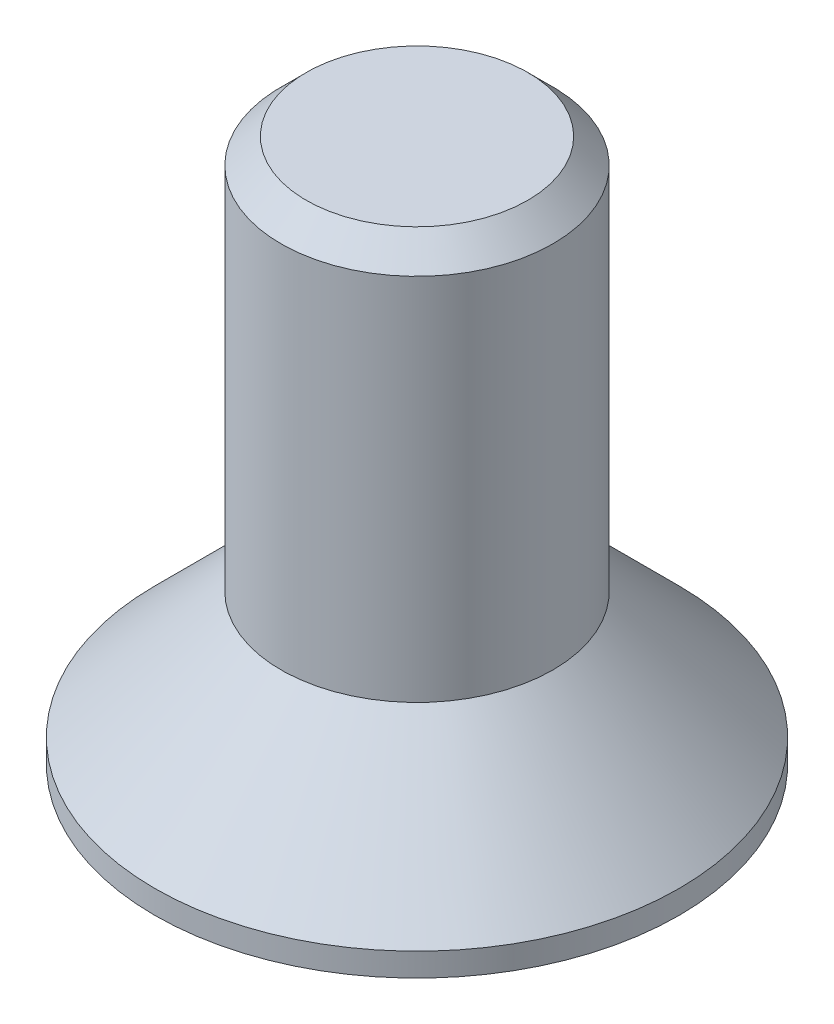
ISO-10303-21;
HEADER;
FILE_DESCRIPTION(('STEP AP214'),'2;1');
FILE_NAME('part.step','',(''),(''),'','','');
FILE_SCHEMA(('AUTOMOTIVE_DESIGN { 1 0 10303 214 1 1 1 1 }'));
ENDSEC;
DATA;
#1=APPLICATION_CONTEXT('core data for automotive mechanical design processes');
#2=APPLICATION_PROTOCOL_DEFINITION('international standard','automotive_design',2000,#1);
#3=PRODUCT_CONTEXT('',#1,'mechanical');
#4=PRODUCT('Part','Part','',(#3));
#5=PRODUCT_RELATED_PRODUCT_CATEGORY('part','',(#4));
#6=PRODUCT_DEFINITION_FORMATION('','',#4);
#7=PRODUCT_DEFINITION_CONTEXT('part definition',#1,'design');
#8=PRODUCT_DEFINITION('design','',#6,#7);
#9=PRODUCT_DEFINITION_SHAPE('','',#8);
#10=(LENGTH_UNIT() NAMED_UNIT(*) SI_UNIT(.MILLI.,.METRE.));
#11=(NAMED_UNIT(*) PLANE_ANGLE_UNIT() SI_UNIT($,.RADIAN.));
#12=(NAMED_UNIT(*) SI_UNIT($,.STERADIAN.) SOLID_ANGLE_UNIT());
#13=UNCERTAINTY_MEASURE_WITH_UNIT(LENGTH_MEASURE(1.E-05),#10,'distance_accuracy_value','');
#14=(GEOMETRIC_REPRESENTATION_CONTEXT(3) GLOBAL_UNCERTAINTY_ASSIGNED_CONTEXT((#13)) GLOBAL_UNIT_ASSIGNED_CONTEXT((#10,
#11,#12)) REPRESENTATION_CONTEXT('',''));
#15=CARTESIAN_POINT('',(0.,0.,0.));
#16=DIRECTION('',(0.,0.,1.));
#17=DIRECTION('',(1.,0.,0.));
#18=AXIS2_PLACEMENT_3D('',#15,#16,#17);
#19=CARTESIAN_POINT('',(2.32094808214229,2.50000000000001,0.));
#20=DIRECTION('',(0.,-1.,0.));
#21=DIRECTION('',(1.,0.,0.));
#22=AXIS2_PLACEMENT_3D('',#19,#20,#21);
#23=PLANE('',#22);
#24=DIRECTION('',(0.499999999999997,0.,-0.86602540378444));
#25=VECTOR('',#24,1.);
#26=CARTESIAN_POINT('',(-1.74071106160673,2.5,-1.005));
#27=LINE('',#26,#25);
#28=CARTESIAN_POINT('',(-1.74071106159993,2.50000000002728,-1.00499999999607));
#29=VERTEX_POINT('',#28);
#30=CARTESIAN_POINT('',(-1.16047404107116,2.5,-2.01));
#31=VERTEX_POINT('',#30);
#32=EDGE_CURVE('E94',#29,#31,#27,.T.);
#33=ORIENTED_EDGE('',*,*,#32,.T.);
#34=DIRECTION('',(1.,0.,0.));
#35=VECTOR('',#34,1.);
#36=CARTESIAN_POINT('',(2.32094808214229,2.50000000000001,-2.01));
#37=LINE('',#36,#35);
#38=CARTESIAN_POINT('',(0.,2.50000000002729,-2.00999999999215));
#39=VERTEX_POINT('',#38);
#40=EDGE_CURVE('E103',#31,#39,#37,.T.);
#41=ORIENTED_EDGE('',*,*,#40,.T.);
#42=CARTESIAN_POINT('',(0.,2.50000000005457,0.));
#43=DIRECTION('',(0.,-1.,0.));
#44=DIRECTION('',(1.,0.,0.));
#45=AXIS2_PLACEMENT_3D('',#42,#43,#44);
#46=CIRCLE('',#45,2.0099999999843);
#47=EDGE_CURVE('E20',#39,#29,#46,.F.);
#48=ORIENTED_EDGE('',*,*,#47,.T.);
#49=EDGE_LOOP('',(#33,#41,#48));
#50=FACE_BOUND('',#49,.T.);
#51=ADVANCED_FACE('F17',(#50),#23,.T.);
#52=CARTESIAN_POINT('',(2.32094808214229,2.50000000000001,0.));
#53=DIRECTION('',(0.,-1.,0.));
#54=DIRECTION('',(1.,0.,0.));
#55=AXIS2_PLACEMENT_3D('',#52,#53,#54);
#56=PLANE('',#55);
#57=DIRECTION('',(-0.499999999999998,0.,-0.86602540378444));
#58=VECTOR('',#57,1.);
#59=CARTESIAN_POINT('',(-1.74071106160673,2.5,1.005));
#60=LINE('',#59,#58);
#61=CARTESIAN_POINT('',(-1.74071106159993,2.50000000002728,1.00499999999608));
#62=VERTEX_POINT('',#61);
#63=CARTESIAN_POINT('',(-2.3209480821423,2.49999999999999,0.));
#64=VERTEX_POINT('',#63);
#65=EDGE_CURVE('E117',#62,#64,#60,.T.);
#66=ORIENTED_EDGE('',*,*,#65,.T.);
#67=DIRECTION('',(0.499999999999998,0.,-0.86602540378444));
#68=VECTOR('',#67,1.);
#69=CARTESIAN_POINT('',(-2.3209480821423,2.49999999999999,0.));
#70=LINE('',#69,#68);
#71=EDGE_CURVE('E98',#64,#29,#70,.T.);
#72=ORIENTED_EDGE('',*,*,#71,.T.);
#73=CARTESIAN_POINT('',(0.,2.50000000005457,0.));
#74=DIRECTION('',(0.,-1.,0.));
#75=DIRECTION('',(1.,0.,0.));
#76=AXIS2_PLACEMENT_3D('',#73,#74,#75);
#77=CIRCLE('',#76,2.0099999999843);
#78=EDGE_CURVE('E110',#29,#62,#77,.F.);
#79=ORIENTED_EDGE('',*,*,#78,.T.);
#80=EDGE_LOOP('',(#66,#72,#79));
#81=FACE_BOUND('',#80,.T.);
#82=ADVANCED_FACE('F115',(#81),#56,.T.);
#83=CARTESIAN_POINT('',(2.32094808214229,2.50000000000001,0.));
#84=DIRECTION('',(0.,-1.,0.));
#85=DIRECTION('',(1.,0.,0.));
#86=AXIS2_PLACEMENT_3D('',#83,#84,#85);
#87=PLANE('',#86);
#88=DIRECTION('',(1.,0.,0.));
#89=VECTOR('',#88,1.);
#90=CARTESIAN_POINT('',(2.32094808214229,2.50000000000001,2.01));
#91=LINE('',#90,#89);
#92=CARTESIAN_POINT('',(0.,2.50000000002729,2.00999999999215));
#93=VERTEX_POINT('',#92);
#94=CARTESIAN_POINT('',(-1.16047404107116,2.5,2.01));
#95=VERTEX_POINT('',#94);
#96=EDGE_CURVE('E118',#93,#95,#91,.F.);
#97=ORIENTED_EDGE('',*,*,#96,.T.);
#98=DIRECTION('',(-0.499999999999997,0.,-0.86602540378444));
#99=VECTOR('',#98,1.);
#100=CARTESIAN_POINT('',(-1.16047404107116,2.5,2.01));
#101=LINE('',#100,#99);
#102=EDGE_CURVE('E180',#95,#62,#101,.T.);
#103=ORIENTED_EDGE('',*,*,#102,.T.);
#104=CARTESIAN_POINT('',(0.,2.50000000005457,0.));
#105=DIRECTION('',(0.,-1.,0.));
#106=DIRECTION('',(1.,0.,0.));
#107=AXIS2_PLACEMENT_3D('',#104,#105,#106);
#108=CIRCLE('',#107,2.0099999999843);
#109=EDGE_CURVE('E125',#62,#93,#108,.F.);
#110=ORIENTED_EDGE('',*,*,#109,.T.);
#111=EDGE_LOOP('',(#97,#103,#110));
#112=FACE_BOUND('',#111,.T.);
#113=ADVANCED_FACE('F394',(#112),#87,.T.);
#114=CARTESIAN_POINT('',(2.32094808214229,2.50000000000001,0.));
#115=DIRECTION('',(0.,-1.,0.));
#116=DIRECTION('',(1.,0.,0.));
#117=AXIS2_PLACEMENT_3D('',#114,#115,#116);
#118=PLANE('',#117);
#119=DIRECTION('',(-0.499999999999997,0.,0.86602540378444));
#120=VECTOR('',#119,1.);
#121=CARTESIAN_POINT('',(1.74071106160671,2.50000000000001,1.005));
#122=LINE('',#121,#120);
#123=CARTESIAN_POINT('',(1.74071106159991,2.50000000002729,1.00499999999608));
#124=VERTEX_POINT('',#123);
#125=CARTESIAN_POINT('',(1.16047404107114,2.50000000000001,2.01));
#126=VERTEX_POINT('',#125);
#127=EDGE_CURVE('E184',#124,#126,#122,.T.);
#128=ORIENTED_EDGE('',*,*,#127,.T.);
#129=DIRECTION('',(1.,0.,0.));
#130=VECTOR('',#129,1.);
#131=CARTESIAN_POINT('',(2.32094808214229,2.50000000000001,2.01));
#132=LINE('',#131,#130);
#133=EDGE_CURVE('E189',#126,#93,#132,.F.);
#134=ORIENTED_EDGE('',*,*,#133,.T.);
#135=CARTESIAN_POINT('',(0.,2.50000000005457,0.));
#136=DIRECTION('',(0.,-1.,0.));
#137=DIRECTION('',(1.,0.,0.));
#138=AXIS2_PLACEMENT_3D('',#135,#136,#137);
#139=CIRCLE('',#138,2.0099999999843);
#140=EDGE_CURVE('E126',#93,#124,#139,.F.);
#141=ORIENTED_EDGE('',*,*,#140,.T.);
#142=EDGE_LOOP('',(#128,#134,#141));
#143=FACE_BOUND('',#142,.T.);
#144=ADVANCED_FACE('F384',(#143),#118,.T.);
#145=CARTESIAN_POINT('',(2.32094808214229,2.50000000000001,0.));
#146=DIRECTION('',(0.,-1.,0.));
#147=DIRECTION('',(1.,0.,0.));
#148=AXIS2_PLACEMENT_3D('',#145,#146,#147);
#149=PLANE('',#148);
#150=DIRECTION('',(1.,0.,0.));
#151=VECTOR('',#150,1.);
#152=CARTESIAN_POINT('',(2.32094808214229,2.50000000000001,-2.01));
#153=LINE('',#152,#151);
#154=CARTESIAN_POINT('',(1.16047404107114,2.50000000000001,-2.01));
#155=VERTEX_POINT('',#154);
#156=EDGE_CURVE('E88',#39,#155,#153,.T.);
#157=ORIENTED_EDGE('',*,*,#156,.T.);
#158=DIRECTION('',(0.499999999999997,0.,0.86602540378444));
#159=VECTOR('',#158,1.);
#160=CARTESIAN_POINT('',(1.16047404107114,2.50000000000001,-2.01));
#161=LINE('',#160,#159);
#162=CARTESIAN_POINT('',(1.74071106159991,2.50000000002729,-1.00499999999608));
#163=VERTEX_POINT('',#162);
#164=EDGE_CURVE('E111',#155,#163,#161,.T.);
#165=ORIENTED_EDGE('',*,*,#164,.T.);
#166=CARTESIAN_POINT('',(0.,2.50000000005457,0.));
#167=DIRECTION('',(0.,-1.,0.));
#168=DIRECTION('',(1.,0.,0.));
#169=AXIS2_PLACEMENT_3D('',#166,#167,#168);
#170=CIRCLE('',#169,2.0099999999843);
#171=EDGE_CURVE('E131',#163,#39,#170,.F.);
#172=ORIENTED_EDGE('',*,*,#171,.T.);
#173=EDGE_LOOP('',(#157,#165,#172));
#174=FACE_BOUND('',#173,.T.);
#175=ADVANCED_FACE('F374',(#174),#149,.T.);
#176=CARTESIAN_POINT('',(0.,2.50000000005457,0.));
#177=DIRECTION('',(0.,-1.,0.));
#178=DIRECTION('',(1.,0.,0.));
#179=AXIS2_PLACEMENT_3D('',#176,#177,#178);
#180=CONICAL_SURFACE('',#179,2.0099999999843,1.04719755119828);
#181=CARTESIAN_POINT('',(0.,3.66047404111214,0.));
#182=VERTEX_POINT('',#181);
#183=VERTEX_LOOP('',#182);
#184=FACE_BOUND('',#183,.T.);
#185=CARTESIAN_POINT('',(0.,2.50000000005457,0.));
#186=DIRECTION('',(0.,-1.,0.));
#187=DIRECTION('',(1.,0.,0.));
#188=AXIS2_PLACEMENT_3D('',#185,#186,#187);
#189=CIRCLE('',#188,2.0099999999843);
#190=EDGE_CURVE('E133',#124,#163,#189,.F.);
#191=ORIENTED_EDGE('',*,*,#190,.F.);
#192=ORIENTED_EDGE('',*,*,#140,.F.);
#193=ORIENTED_EDGE('',*,*,#109,.F.);
#194=ORIENTED_EDGE('',*,*,#78,.F.);
#195=ORIENTED_EDGE('',*,*,#47,.F.);
#196=ORIENTED_EDGE('',*,*,#171,.F.);
#197=EDGE_LOOP('',(#191,#192,#193,#194,#195,#196));
#198=FACE_BOUND('',#197,.T.);
#199=ADVANCED_FACE('F122',(#184,#198),#180,.F.);
#200=CARTESIAN_POINT('',(2.32094808214229,2.50000000000001,0.));
#201=DIRECTION('',(0.,-1.,0.));
#202=DIRECTION('',(1.,0.,0.));
#203=AXIS2_PLACEMENT_3D('',#200,#201,#202);
#204=PLANE('',#203);
#205=DIRECTION('',(0.500000000000004,0.,0.866025403784436));
#206=VECTOR('',#205,1.);
#207=CARTESIAN_POINT('',(1.74071106160671,2.50000000000001,-1.005));
#208=LINE('',#207,#206);
#209=CARTESIAN_POINT('',(2.32094808214229,2.50000000000001,0.));
#210=VERTEX_POINT('',#209);
#211=EDGE_CURVE('E136',#163,#210,#208,.T.);
#212=ORIENTED_EDGE('',*,*,#211,.T.);
#213=DIRECTION('',(-0.500000000000001,0.,0.866025403784438));
#214=VECTOR('',#213,1.);
#215=CARTESIAN_POINT('',(1.16047404107114,2.50000000000001,2.01));
#216=LINE('',#215,#214);
#217=EDGE_CURVE('E204',#124,#210,#216,.F.);
#218=ORIENTED_EDGE('',*,*,#217,.F.);
#219=ORIENTED_EDGE('',*,*,#190,.T.);
#220=EDGE_LOOP('',(#212,#218,#219));
#221=FACE_BOUND('',#220,.T.);
#222=ADVANCED_FACE('F355',(#221),#204,.T.);
#223=CARTESIAN_POINT('',(1.16047404107114,2.5,2.01));
#224=DIRECTION('',(-0.866025403784438,0.,-0.500000000000001));
#225=DIRECTION('',(-0.500000000000001,0.,0.866025403784438));
#226=AXIS2_PLACEMENT_3D('',#223,#224,#225);
#227=PLANE('',#226);
#228=ORIENTED_EDGE('',*,*,#217,.T.);
#229=DIRECTION('',(0.,1.,0.));
#230=VECTOR('',#229,1.);
#231=CARTESIAN_POINT('',(2.32094808214229,2.50000000000001,0.));
#232=LINE('',#231,#230);
#233=CARTESIAN_POINT('',(2.3209480821423,0.,0.));
#234=VERTEX_POINT('',#233);
#235=EDGE_CURVE('E165',#234,#210,#232,.T.);
#236=ORIENTED_EDGE('',*,*,#235,.F.);
#237=DIRECTION('',(0.500000000000001,0.,-0.866025403784438));
#238=VECTOR('',#237,1.);
#239=CARTESIAN_POINT('',(1.16047404107115,0.,2.01));
#240=LINE('',#239,#238);
#241=CARTESIAN_POINT('',(1.16047404107115,0.,2.01));
#242=VERTEX_POINT('',#241);
#243=EDGE_CURVE('E161',#242,#234,#240,.T.);
#244=ORIENTED_EDGE('',*,*,#243,.F.);
#245=DIRECTION('',(0.,1.,0.));
#246=VECTOR('',#245,1.);
#247=CARTESIAN_POINT('',(1.16047404107114,2.5,2.01));
#248=LINE('',#247,#246);
#249=EDGE_CURVE('E156',#126,#242,#248,.F.);
#250=ORIENTED_EDGE('',*,*,#249,.F.);
#251=ORIENTED_EDGE('',*,*,#127,.F.);
#252=EDGE_LOOP('',(#228,#236,#244,#250,#251));
#253=FACE_BOUND('',#252,.T.);
#254=ADVANCED_FACE('F345',(#253),#227,.T.);
#255=CARTESIAN_POINT('',(2.32094808214229,2.50000000000001,0.));
#256=DIRECTION('',(-0.866025403784438,0.,0.500000000000001));
#257=DIRECTION('',(0.500000000000001,0.,0.866025403784438));
#258=AXIS2_PLACEMENT_3D('',#255,#256,#257);
#259=PLANE('',#258);
#260=ORIENTED_EDGE('',*,*,#164,.F.);
#261=DIRECTION('',(0.,1.,0.));
#262=VECTOR('',#261,1.);
#263=CARTESIAN_POINT('',(1.16047404107115,2.5,-2.01));
#264=LINE('',#263,#262);
#265=CARTESIAN_POINT('',(1.16047404107115,0.,-2.01));
#266=VERTEX_POINT('',#265);
#267=EDGE_CURVE('E149',#266,#155,#264,.T.);
#268=ORIENTED_EDGE('',*,*,#267,.F.);
#269=DIRECTION('',(-0.500000000000001,0.,-0.866025403784438));
#270=VECTOR('',#269,1.);
#271=CARTESIAN_POINT('',(2.3209480821423,0.,0.));
#272=LINE('',#271,#270);
#273=EDGE_CURVE('E214',#234,#266,#272,.T.);
#274=ORIENTED_EDGE('',*,*,#273,.F.);
#275=ORIENTED_EDGE('',*,*,#235,.T.);
#276=ORIENTED_EDGE('',*,*,#211,.F.);
#277=EDGE_LOOP('',(#260,#268,#274,#275,#276));
#278=FACE_BOUND('',#277,.T.);
#279=ADVANCED_FACE('F336',(#278),#259,.T.);
#280=CARTESIAN_POINT('',(1.16047404107114,2.5,-2.01));
#281=DIRECTION('',(0.,0.,1.));
#282=DIRECTION('',(1.,0.,0.));
#283=AXIS2_PLACEMENT_3D('',#280,#281,#282);
#284=PLANE('',#283);
#285=ORIENTED_EDGE('',*,*,#40,.F.);
#286=DIRECTION('',(0.,1.,0.));
#287=VECTOR('',#286,1.);
#288=CARTESIAN_POINT('',(-1.16047404107116,2.5,-2.01));
#289=LINE('',#288,#287);
#290=CARTESIAN_POINT('',(-1.16047404107116,0.,-2.01));
#291=VERTEX_POINT('',#290);
#292=EDGE_CURVE('E101',#291,#31,#289,.T.);
#293=ORIENTED_EDGE('',*,*,#292,.F.);
#294=DIRECTION('',(1.,0.,0.));
#295=VECTOR('',#294,1.);
#296=CARTESIAN_POINT('',(0.,0.,-2.01));
#297=LINE('',#296,#295);
#298=EDGE_CURVE('E217',#266,#291,#297,.F.);
#299=ORIENTED_EDGE('',*,*,#298,.F.);
#300=ORIENTED_EDGE('',*,*,#267,.T.);
#301=ORIENTED_EDGE('',*,*,#156,.F.);
#302=EDGE_LOOP('',(#285,#293,#299,#300,#301));
#303=FACE_BOUND('',#302,.T.);
#304=ADVANCED_FACE('F327',(#303),#284,.T.);
#305=CARTESIAN_POINT('',(-1.16047404107116,2.5,-2.01));
#306=DIRECTION('',(0.866025403784439,0.,0.5));
#307=DIRECTION('',(0.5,0.,-0.866025403784439));
#308=AXIS2_PLACEMENT_3D('',#305,#306,#307);
#309=PLANE('',#308);
#310=ORIENTED_EDGE('',*,*,#71,.F.);
#311=DIRECTION('',(0.,1.,0.));
#312=VECTOR('',#311,1.);
#313=CARTESIAN_POINT('',(-2.3209480821423,2.5,0.));
#314=LINE('',#313,#312);
#315=CARTESIAN_POINT('',(-2.3209480821423,0.,0.));
#316=VERTEX_POINT('',#315);
#317=EDGE_CURVE('E148',#316,#64,#314,.T.);
#318=ORIENTED_EDGE('',*,*,#317,.F.);
#319=DIRECTION('',(-0.500000000000001,0.,0.866025403784438));
#320=VECTOR('',#319,1.);
#321=CARTESIAN_POINT('',(-1.16047404107115,0.,-2.01));
#322=LINE('',#321,#320);
#323=EDGE_CURVE('E220',#291,#316,#322,.T.);
#324=ORIENTED_EDGE('',*,*,#323,.F.);
#325=ORIENTED_EDGE('',*,*,#292,.T.);
#326=ORIENTED_EDGE('',*,*,#32,.F.);
#327=EDGE_LOOP('',(#310,#318,#324,#325,#326));
#328=FACE_BOUND('',#327,.T.);
#329=ADVANCED_FACE('F96',(#328),#309,.T.);
#330=CARTESIAN_POINT('',(-2.3209480821423,2.5,0.));
#331=DIRECTION('',(0.866025403784439,0.,-0.5));
#332=DIRECTION('',(-0.5,0.,-0.866025403784439));
#333=AXIS2_PLACEMENT_3D('',#330,#331,#332);
#334=PLANE('',#333);
#335=ORIENTED_EDGE('',*,*,#102,.F.);
#336=DIRECTION('',(0.,1.,0.));
#337=VECTOR('',#336,1.);
#338=CARTESIAN_POINT('',(-1.16047404107115,2.5,2.01));
#339=LINE('',#338,#337);
#340=CARTESIAN_POINT('',(-1.16047404107115,0.,2.01));
#341=VERTEX_POINT('',#340);
#342=EDGE_CURVE('E35',#341,#95,#339,.T.);
#343=ORIENTED_EDGE('',*,*,#342,.F.);
#344=DIRECTION('',(0.500000000000001,0.,0.866025403784438));
#345=VECTOR('',#344,1.);
#346=CARTESIAN_POINT('',(-2.3209480821423,0.,0.));
#347=LINE('',#346,#345);
#348=EDGE_CURVE('E223',#316,#341,#347,.T.);
#349=ORIENTED_EDGE('',*,*,#348,.F.);
#350=ORIENTED_EDGE('',*,*,#317,.T.);
#351=ORIENTED_EDGE('',*,*,#65,.F.);
#352=EDGE_LOOP('',(#335,#343,#349,#350,#351));
#353=FACE_BOUND('',#352,.T.);
#354=ADVANCED_FACE('F309',(#353),#334,.T.);
#355=CARTESIAN_POINT('',(-1.16047404107116,2.5,2.01));
#356=DIRECTION('',(0.,0.,-1.));
#357=DIRECTION('',(-1.,0.,0.));
#358=AXIS2_PLACEMENT_3D('',#355,#356,#357);
#359=PLANE('',#358);
#360=ORIENTED_EDGE('',*,*,#133,.F.);
#361=ORIENTED_EDGE('',*,*,#249,.T.);
#362=DIRECTION('',(1.,0.,0.));
#363=VECTOR('',#362,1.);
#364=CARTESIAN_POINT('',(0.,0.,2.01));
#365=LINE('',#364,#363);
#366=EDGE_CURVE('E141',#341,#242,#365,.T.);
#367=ORIENTED_EDGE('',*,*,#366,.F.);
#368=ORIENTED_EDGE('',*,*,#342,.T.);
#369=ORIENTED_EDGE('',*,*,#96,.F.);
#370=EDGE_LOOP('',(#360,#361,#367,#368,#369));
#371=FACE_BOUND('',#370,.T.);
#372=ADVANCED_FACE('F260',(#371),#359,.T.);
#373=CARTESIAN_POINT('',(0.,0.,0.));
#374=DIRECTION('',(0.,-1.,0.));
#375=DIRECTION('',(1.,0.,0.));
#376=AXIS2_PLACEMENT_3D('',#373,#374,#375);
#377=PLANE('',#376);
#378=ORIENTED_EDGE('',*,*,#348,.T.);
#379=ORIENTED_EDGE('',*,*,#366,.T.);
#380=ORIENTED_EDGE('',*,*,#243,.T.);
#381=ORIENTED_EDGE('',*,*,#273,.T.);
#382=ORIENTED_EDGE('',*,*,#298,.T.);
#383=ORIENTED_EDGE('',*,*,#323,.T.);
#384=EDGE_LOOP('',(#378,#379,#380,#381,#382,#383));
#385=FACE_BOUND('',#384,.T.);
#386=CARTESIAN_POINT('',(0.,0.,0.));
#387=DIRECTION('',(0.,-1.,0.));
#388=DIRECTION('',(1.,0.,0.));
#389=AXIS2_PLACEMENT_3D('',#386,#387,#388);
#390=CIRCLE('',#389,5.785);
#391=CARTESIAN_POINT('',(5.785,0.,0.));
#392=VERTEX_POINT('',#391);
#393=EDGE_CURVE('E137',#392,#392,#390,.F.);
#394=ORIENTED_EDGE('',*,*,#393,.F.);
#395=EDGE_LOOP('',(#394));
#396=FACE_BOUND('',#395,.T.);
#397=ADVANCED_FACE('F251',(#385,#396),#377,.T.);
#398=CARTESIAN_POINT('',(-2.44550000000004,12.,0.));
#399=DIRECTION('',(0.,1.,0.));
#400=DIRECTION('',(-1.,0.,0.));
#401=AXIS2_PLACEMENT_3D('',#398,#399,#400);
#402=PLANE('',#401);
#403=CARTESIAN_POINT('',(0.,12.0000000000573,0.));
#404=DIRECTION('',(0.,-1.,0.));
#405=DIRECTION('',(1.,0.,0.));
#406=AXIS2_PLACEMENT_3D('',#403,#404,#405);
#407=CIRCLE('',#406,2.4454999999648);
#408=CARTESIAN_POINT('',(2.44549999996475,12.0000000000573,0.));
#409=VERTEX_POINT('',#408);
#410=EDGE_CURVE('E140',#409,#409,#407,.T.);
#411=ORIENTED_EDGE('',*,*,#410,.F.);
#412=EDGE_LOOP('',(#411));
#413=FACE_BOUND('',#412,.T.);
#414=ADVANCED_FACE('F249',(#413),#402,.T.);
#415=CARTESIAN_POINT('',(0.,0.,0.));
#416=DIRECTION('',(0.,-1.,0.));
#417=DIRECTION('',(1.,0.,0.));
#418=AXIS2_PLACEMENT_3D('',#415,#416,#417);
#419=CYLINDRICAL_SURFACE('',#418,5.785);
#420=ORIENTED_EDGE('',*,*,#393,.T.);
#421=EDGE_LOOP('',(#420));
#422=FACE_BOUND('',#421,.T.);
#423=CARTESIAN_POINT('',(0.,0.514999999950305,0.));
#424=DIRECTION('',(0.,-1.,0.));
#425=DIRECTION('',(0.,0.,1.));
#426=AXIS2_PLACEMENT_3D('',#423,#424,#425);
#427=CIRCLE('',#426,5.78500000005988);
#428=CARTESIAN_POINT('',(0.,0.514999999950305,5.78500000005988));
#429=VERTEX_POINT('',#428);
#430=EDGE_CURVE('E144',#429,#429,#427,.F.);
#431=ORIENTED_EDGE('',*,*,#430,.F.);
#432=EDGE_LOOP('',(#431));
#433=FACE_BOUND('',#432,.T.);
#434=ADVANCED_FACE('F245',(#422,#433),#419,.T.);
#435=CARTESIAN_POINT('',(0.,11.4455000000362,0.));
#436=DIRECTION('',(0.,-1.,0.));
#437=DIRECTION('',(1.,0.,0.));
#438=AXIS2_PLACEMENT_3D('',#435,#436,#437);
#439=CONICAL_SURFACE('',#438,3.00000000004275,0.785398163448705);
#440=CARTESIAN_POINT('',(0.,11.4455,0.));
#441=DIRECTION('',(0.,-1.,0.));
#442=DIRECTION('',(1.,0.,0.));
#443=AXIS2_PLACEMENT_3D('',#440,#441,#442);
#444=CIRCLE('',#443,2.99999999999998);
#445=CARTESIAN_POINT('',(2.99999999999994,11.4455,0.));
#446=VERTEX_POINT('',#445);
#447=EDGE_CURVE('E26',#446,#446,#444,.T.);
#448=ORIENTED_EDGE('',*,*,#447,.F.);
#449=EDGE_LOOP('',(#448));
#450=FACE_BOUND('',#449,.T.);
#451=ORIENTED_EDGE('',*,*,#410,.T.);
#452=EDGE_LOOP('',(#451));
#453=FACE_BOUND('',#452,.T.);
#454=ADVANCED_FACE('F241',(#450,#453),#439,.T.);
#455=CARTESIAN_POINT('',(0.,0.515000000063992,0.));
#456=DIRECTION('',(0.,-1.,0.));
#457=DIRECTION('',(1.,0.,0.));
#458=AXIS2_PLACEMENT_3D('',#455,#456,#457);
#459=CONICAL_SURFACE('',#458,5.78500000000304,0.785398163407654);
#460=ORIENTED_EDGE('',*,*,#430,.T.);
#461=EDGE_LOOP('',(#460));
#462=FACE_BOUND('',#461,.T.);
#463=CARTESIAN_POINT('',(0.,3.3,0.));
#464=DIRECTION('',(0.,-1.,0.));
#465=DIRECTION('',(1.,0.,0.));
#466=AXIS2_PLACEMENT_3D('',#463,#464,#465);
#467=CIRCLE('',#466,2.99999999999998);
#468=CARTESIAN_POINT('',(2.99999999999997,3.30000000000001,0.));
#469=VERTEX_POINT('',#468);
#470=EDGE_CURVE('E11',#469,#469,#467,.F.);
#471=ORIENTED_EDGE('',*,*,#470,.F.);
#472=EDGE_LOOP('',(#471));
#473=FACE_BOUND('',#472,.T.);
#474=ADVANCED_FACE('F244',(#462,#473),#459,.T.);
#475=CARTESIAN_POINT('',(0.,0.,0.));
#476=DIRECTION('',(0.,-1.,0.));
#477=DIRECTION('',(1.,0.,0.));
#478=AXIS2_PLACEMENT_3D('',#475,#476,#477);
#479=CYLINDRICAL_SURFACE('',#478,2.99999999999998);
#480=ORIENTED_EDGE('',*,*,#470,.T.);
#481=EDGE_LOOP('',(#480));
#482=FACE_BOUND('',#481,.T.);
#483=ORIENTED_EDGE('',*,*,#447,.T.);
#484=EDGE_LOOP('',(#483));
#485=FACE_BOUND('',#484,.T.);
#486=ADVANCED_FACE('F239',(#482,#485),#479,.T.);
#487=CLOSED_SHELL('',(#51,#82,#113,#144,#175,#199,#222,#254,#279,#304,#329,#354,#372,#397,#414,
#434,#454,#474,#486));
#488=MANIFOLD_SOLID_BREP('B1',#487);
#489=ADVANCED_BREP_SHAPE_REPRESENTATION('',(#18,#488),#14);
#490=SHAPE_DEFINITION_REPRESENTATION(#9,#489);
ENDSEC;
END-ISO-10303-21;
